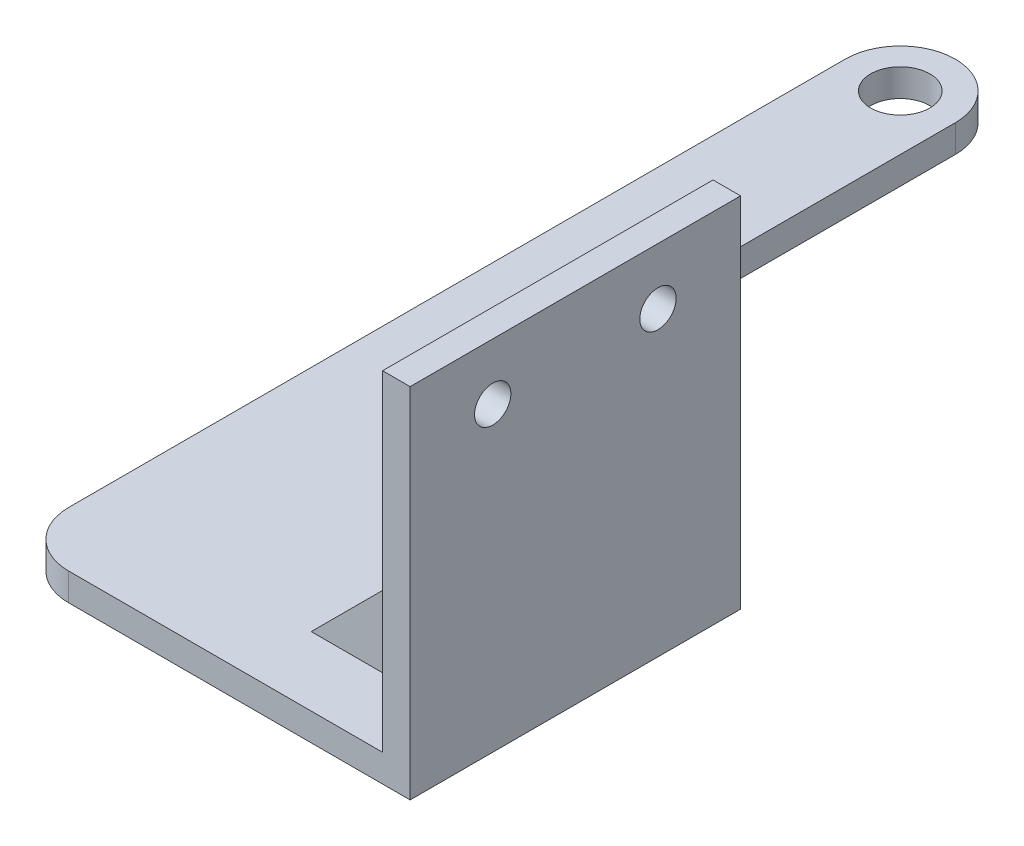
ISO-10303-21;
HEADER;
FILE_DESCRIPTION(('STEP AP214'),'2;1');
FILE_NAME('part.step','',(''),(''),'','','');
FILE_SCHEMA(('AUTOMOTIVE_DESIGN { 1 0 10303 214 1 1 1 1 }'));
ENDSEC;
DATA;
#1=APPLICATION_CONTEXT('core data for automotive mechanical design processes');
#2=APPLICATION_PROTOCOL_DEFINITION('international standard','automotive_design',2000,#1);
#3=PRODUCT_CONTEXT('',#1,'mechanical');
#4=PRODUCT('Part','Part','',(#3));
#5=PRODUCT_RELATED_PRODUCT_CATEGORY('part','',(#4));
#6=PRODUCT_DEFINITION_FORMATION('','',#4);
#7=PRODUCT_DEFINITION_CONTEXT('part definition',#1,'design');
#8=PRODUCT_DEFINITION('design','',#6,#7);
#9=PRODUCT_DEFINITION_SHAPE('','',#8);
#10=(LENGTH_UNIT() NAMED_UNIT(*) SI_UNIT(.MILLI.,.METRE.));
#11=(NAMED_UNIT(*) PLANE_ANGLE_UNIT() SI_UNIT($,.RADIAN.));
#12=(NAMED_UNIT(*) SI_UNIT($,.STERADIAN.) SOLID_ANGLE_UNIT());
#13=UNCERTAINTY_MEASURE_WITH_UNIT(LENGTH_MEASURE(1.E-05),#10,'distance_accuracy_value','');
#14=(GEOMETRIC_REPRESENTATION_CONTEXT(3) GLOBAL_UNCERTAINTY_ASSIGNED_CONTEXT((#13)) GLOBAL_UNIT_ASSIGNED_CONTEXT((#10,
#11,#12)) REPRESENTATION_CONTEXT('',''));
#15=CARTESIAN_POINT('',(0.,0.,0.));
#16=DIRECTION('',(0.,0.,1.));
#17=DIRECTION('',(1.,0.,0.));
#18=AXIS2_PLACEMENT_3D('',#15,#16,#17);
#19=CARTESIAN_POINT('',(-4.99999999999999,-50.,60.));
#20=DIRECTION('',(1.,0.,0.));
#21=DIRECTION('',(0.,1.,0.));
#22=AXIS2_PLACEMENT_3D('',#19,#20,#21);
#23=PLANE('',#22);
#24=CARTESIAN_POINT('',(-4.99999999999998,-10.25,45.));
#25=DIRECTION('',(-1.,0.,0.));
#26=DIRECTION('',(0.,-1.,0.));
#27=AXIS2_PLACEMENT_3D('',#24,#25,#26);
#28=CIRCLE('',#27,3.3);
#29=CARTESIAN_POINT('',(-4.99999999999998,-13.55,45.));
#30=VERTEX_POINT('',#29);
#31=EDGE_CURVE('E204',#30,#30,#28,.T.);
#32=ORIENTED_EDGE('',*,*,#31,.F.);
#33=EDGE_LOOP('',(#32));
#34=FACE_BOUND('',#33,.T.);
#35=CARTESIAN_POINT('',(-4.99999999999998,-10.25,15.));
#36=DIRECTION('',(-1.,0.,0.));
#37=DIRECTION('',(0.,-1.,0.));
#38=AXIS2_PLACEMENT_3D('',#35,#36,#37);
#39=CIRCLE('',#38,3.3);
#40=CARTESIAN_POINT('',(-4.99999999999998,-13.55,15.));
#41=VERTEX_POINT('',#40);
#42=EDGE_CURVE('E208',#41,#41,#39,.T.);
#43=ORIENTED_EDGE('',*,*,#42,.F.);
#44=EDGE_LOOP('',(#43));
#45=FACE_BOUND('',#44,.T.);
#46=DIRECTION('',(0.,1.,0.));
#47=VECTOR('',#46,1.);
#48=CARTESIAN_POINT('',(-4.99999999999999,-60.,17.5));
#49=LINE('',#48,#47);
#50=CARTESIAN_POINT('',(-4.99999999999999,-60.,17.5));
#51=VERTEX_POINT('',#50);
#52=CARTESIAN_POINT('',(-5.,-34.5441558772843,17.5));
#53=VERTEX_POINT('',#52);
#54=EDGE_CURVE('E161',#51,#53,#49,.T.);
#55=ORIENTED_EDGE('',*,*,#54,.F.);
#56=DIRECTION('',(0.,0.,-1.));
#57=VECTOR('',#56,1.);
#58=CARTESIAN_POINT('',(-4.99999999999998,-60.,0.));
#59=LINE('',#58,#57);
#60=CARTESIAN_POINT('',(-4.99999999999999,-60.,42.5));
#61=VERTEX_POINT('',#60);
#62=EDGE_CURVE('E176',#61,#51,#59,.T.);
#63=ORIENTED_EDGE('',*,*,#62,.F.);
#64=DIRECTION('',(0.,1.,0.));
#65=VECTOR('',#64,1.);
#66=CARTESIAN_POINT('',(-4.99999999999999,-60.,42.5));
#67=LINE('',#66,#65);
#68=CARTESIAN_POINT('',(-5.,-34.5441558772843,42.5));
#69=VERTEX_POINT('',#68);
#70=EDGE_CURVE('E188',#61,#69,#67,.T.);
#71=ORIENTED_EDGE('',*,*,#70,.T.);
#72=DIRECTION('',(0.,0.,1.));
#73=VECTOR('',#72,1.);
#74=CARTESIAN_POINT('',(-5.,-34.5441558772843,42.5));
#75=LINE('',#74,#73);
#76=CARTESIAN_POINT('',(-5.,-34.5441558772843,47.5));
#77=VERTEX_POINT('',#76);
#78=EDGE_CURVE('E194',#69,#77,#75,.T.);
#79=ORIENTED_EDGE('',*,*,#78,.T.);
#80=DIRECTION('',(0.,1.,0.));
#81=VECTOR('',#80,1.);
#82=CARTESIAN_POINT('',(-4.99999999999999,-60.,47.5));
#83=LINE('',#82,#81);
#84=CARTESIAN_POINT('',(-4.99999999999999,-60.,47.5));
#85=VERTEX_POINT('',#84);
#86=EDGE_CURVE('E196',#85,#77,#83,.T.);
#87=ORIENTED_EDGE('',*,*,#86,.F.);
#88=CARTESIAN_POINT('',(-4.99999999999999,-60.,60.));
#89=VERTEX_POINT('',#88);
#90=EDGE_CURVE('E233',#89,#85,#59,.T.);
#91=ORIENTED_EDGE('',*,*,#90,.F.);
#92=DIRECTION('',(0.,-1.,0.));
#93=VECTOR('',#92,1.);
#94=CARTESIAN_POINT('',(-5.,0.,60.));
#95=LINE('',#94,#93);
#96=CARTESIAN_POINT('',(-5.,0.,60.));
#97=VERTEX_POINT('',#96);
#98=EDGE_CURVE('E249',#97,#89,#95,.T.);
#99=ORIENTED_EDGE('',*,*,#98,.F.);
#100=DIRECTION('',(0.,0.,-1.));
#101=VECTOR('',#100,1.);
#102=CARTESIAN_POINT('',(-5.,0.,60.));
#103=LINE('',#102,#101);
#104=CARTESIAN_POINT('',(-5.,0.,0.));
#105=VERTEX_POINT('',#104);
#106=EDGE_CURVE('E266',#97,#105,#103,.T.);
#107=ORIENTED_EDGE('',*,*,#106,.T.);
#108=DIRECTION('',(0.,-1.,0.));
#109=VECTOR('',#108,1.);
#110=CARTESIAN_POINT('',(-4.99999999999999,-50.,0.));
#111=LINE('',#110,#109);
#112=CARTESIAN_POINT('',(-4.99999999999998,-60.,0.));
#113=VERTEX_POINT('',#112);
#114=EDGE_CURVE('E260',#105,#113,#111,.T.);
#115=ORIENTED_EDGE('',*,*,#114,.T.);
#116=CARTESIAN_POINT('',(-4.99999999999998,-60.,12.5));
#117=VERTEX_POINT('',#116);
#118=EDGE_CURVE('E228',#117,#113,#59,.T.);
#119=ORIENTED_EDGE('',*,*,#118,.F.);
#120=DIRECTION('',(0.,1.,0.));
#121=VECTOR('',#120,1.);
#122=CARTESIAN_POINT('',(-4.99999999999999,-60.,12.5));
#123=LINE('',#122,#121);
#124=CARTESIAN_POINT('',(-5.,-34.5441558772843,12.5));
#125=VERTEX_POINT('',#124);
#126=EDGE_CURVE('E51',#117,#125,#123,.T.);
#127=ORIENTED_EDGE('',*,*,#126,.T.);
#128=DIRECTION('',(0.,0.,-1.));
#129=VECTOR('',#128,1.);
#130=CARTESIAN_POINT('',(-5.,-34.5441558772843,17.5));
#131=LINE('',#130,#129);
#132=EDGE_CURVE('E170',#53,#125,#131,.T.);
#133=ORIENTED_EDGE('',*,*,#132,.F.);
#134=EDGE_LOOP('',(#55,#63,#71,#79,#87,#91,#99,#107,#115,#119,#127,#133));
#135=FACE_BOUND('',#134,.T.);
#136=ADVANCED_FACE('F36',(#34,#45,#135),#23,.F.);
#137=CARTESIAN_POINT('',(-72.,-60.,0.));
#138=DIRECTION('',(0.,-1.,0.));
#139=DIRECTION('',(0.,0.,-1.));
#140=AXIS2_PLACEMENT_3D('',#137,#138,#139);
#141=PLANE('',#140);
#142=CARTESIAN_POINT('',(-62.,-60.,-91.));
#143=DIRECTION('',(0.,1.,0.));
#144=DIRECTION('',(0.,0.,1.));
#145=AXIS2_PLACEMENT_3D('',#142,#143,#144);
#146=CIRCLE('',#145,5.37500000000001);
#147=CARTESIAN_POINT('',(-62.,-60.,-85.625));
#148=VERTEX_POINT('',#147);
#149=EDGE_CURVE('E211',#148,#148,#146,.T.);
#150=ORIENTED_EDGE('',*,*,#149,.F.);
#151=EDGE_LOOP('',(#150));
#152=FACE_BOUND('',#151,.T.);
#153=DIRECTION('',(1.,0.,0.));
#154=VECTOR('',#153,1.);
#155=CARTESIAN_POINT('',(-30.4558441227157,-60.,17.5));
#156=LINE('',#155,#154);
#157=CARTESIAN_POINT('',(-30.4558441227157,-60.,17.5));
#158=VERTEX_POINT('',#157);
#159=EDGE_CURVE('E159',#158,#51,#156,.T.);
#160=ORIENTED_EDGE('',*,*,#159,.F.);
#161=DIRECTION('',(0.,0.,-1.));
#162=VECTOR('',#161,1.);
#163=CARTESIAN_POINT('',(-30.4558441227157,-60.,17.5));
#164=LINE('',#163,#162);
#165=CARTESIAN_POINT('',(-30.4558441227157,-60.,12.5));
#166=VERTEX_POINT('',#165);
#167=EDGE_CURVE('E166',#158,#166,#164,.T.);
#168=ORIENTED_EDGE('',*,*,#167,.T.);
#169=DIRECTION('',(1.,0.,0.));
#170=VECTOR('',#169,1.);
#171=CARTESIAN_POINT('',(-30.4558441227157,-60.,12.5));
#172=LINE('',#171,#170);
#173=EDGE_CURVE('E181',#166,#117,#172,.T.);
#174=ORIENTED_EDGE('',*,*,#173,.T.);
#175=ORIENTED_EDGE('',*,*,#118,.T.);
#176=DIRECTION('',(1.,0.,0.));
#177=VECTOR('',#176,1.);
#178=CARTESIAN_POINT('',(-72.,-60.,0.));
#179=LINE('',#178,#177);
#180=CARTESIAN_POINT('',(-42.,-60.,0.));
#181=VERTEX_POINT('',#180);
#182=EDGE_CURVE('E235',#181,#113,#179,.T.);
#183=ORIENTED_EDGE('',*,*,#182,.F.);
#184=CARTESIAN_POINT('',(-42.,-60.,-9.99999999999999));
#185=DIRECTION('',(0.,-1.,0.));
#186=DIRECTION('',(0.,0.,-1.));
#187=AXIS2_PLACEMENT_3D('',#184,#185,#186);
#188=CIRCLE('',#187,10.);
#189=CARTESIAN_POINT('',(-52.,-60.,-9.99999999999999));
#190=VERTEX_POINT('',#189);
#191=EDGE_CURVE('E295',#181,#190,#188,.T.);
#192=ORIENTED_EDGE('',*,*,#191,.T.);
#193=DIRECTION('',(0.,0.,1.));
#194=VECTOR('',#193,1.);
#195=CARTESIAN_POINT('',(-52.,-60.,-101.));
#196=LINE('',#195,#194);
#197=CARTESIAN_POINT('',(-52.,-60.,-91.));
#198=VERTEX_POINT('',#197);
#199=EDGE_CURVE('E225',#198,#190,#196,.T.);
#200=ORIENTED_EDGE('',*,*,#199,.F.);
#201=CARTESIAN_POINT('',(-62.,-60.,-91.));
#202=DIRECTION('',(0.,-1.,0.));
#203=DIRECTION('',(0.,0.,-1.));
#204=AXIS2_PLACEMENT_3D('',#201,#202,#203);
#205=CIRCLE('',#204,10.);
#206=CARTESIAN_POINT('',(-62.,-60.,-101.));
#207=VERTEX_POINT('',#206);
#208=EDGE_CURVE('E282',#198,#207,#205,.F.);
#209=ORIENTED_EDGE('',*,*,#208,.T.);
#210=CARTESIAN_POINT('',(-62.,-60.,-91.));
#211=DIRECTION('',(0.,-1.,0.));
#212=DIRECTION('',(0.,0.,-1.));
#213=AXIS2_PLACEMENT_3D('',#210,#211,#212);
#214=CIRCLE('',#213,10.);
#215=CARTESIAN_POINT('',(-72.,-60.,-91.));
#216=VERTEX_POINT('',#215);
#217=EDGE_CURVE('E279',#207,#216,#214,.F.);
#218=ORIENTED_EDGE('',*,*,#217,.T.);
#219=DIRECTION('',(0.,0.,-1.));
#220=VECTOR('',#219,1.);
#221=CARTESIAN_POINT('',(-72.,-60.,0.));
#222=LINE('',#221,#220);
#223=CARTESIAN_POINT('',(-72.,-60.,50.));
#224=VERTEX_POINT('',#223);
#225=EDGE_CURVE('E232',#224,#216,#222,.T.);
#226=ORIENTED_EDGE('',*,*,#225,.F.);
#227=CARTESIAN_POINT('',(-62.,-60.,50.));
#228=DIRECTION('',(0.,-1.,0.));
#229=DIRECTION('',(0.,0.,-1.));
#230=AXIS2_PLACEMENT_3D('',#227,#228,#229);
#231=CIRCLE('',#230,10.);
#232=CARTESIAN_POINT('',(-62.,-60.,60.));
#233=VERTEX_POINT('',#232);
#234=EDGE_CURVE('E300',#224,#233,#231,.F.);
#235=ORIENTED_EDGE('',*,*,#234,.T.);
#236=DIRECTION('',(1.,0.,0.));
#237=VECTOR('',#236,1.);
#238=CARTESIAN_POINT('',(-72.,-60.,60.));
#239=LINE('',#238,#237);
#240=EDGE_CURVE('E240',#233,#89,#239,.T.);
#241=ORIENTED_EDGE('',*,*,#240,.T.);
#242=ORIENTED_EDGE('',*,*,#90,.T.);
#243=DIRECTION('',(1.,0.,0.));
#244=VECTOR('',#243,1.);
#245=CARTESIAN_POINT('',(-30.4558441227157,-60.,47.5));
#246=LINE('',#245,#244);
#247=CARTESIAN_POINT('',(-30.4558441227157,-60.,47.5));
#248=VERTEX_POINT('',#247);
#249=EDGE_CURVE('E184',#248,#85,#246,.T.);
#250=ORIENTED_EDGE('',*,*,#249,.F.);
#251=DIRECTION('',(0.,0.,1.));
#252=VECTOR('',#251,1.);
#253=CARTESIAN_POINT('',(-30.4558441227157,-60.,42.5));
#254=LINE('',#253,#252);
#255=CARTESIAN_POINT('',(-30.4558441227157,-60.,42.5));
#256=VERTEX_POINT('',#255);
#257=EDGE_CURVE('E199',#256,#248,#254,.T.);
#258=ORIENTED_EDGE('',*,*,#257,.F.);
#259=DIRECTION('',(1.,0.,0.));
#260=VECTOR('',#259,1.);
#261=CARTESIAN_POINT('',(-30.4558441227157,-60.,42.5));
#262=LINE('',#261,#260);
#263=EDGE_CURVE('E186',#256,#61,#262,.T.);
#264=ORIENTED_EDGE('',*,*,#263,.T.);
#265=ORIENTED_EDGE('',*,*,#62,.T.);
#266=EDGE_LOOP('',(#160,#168,#174,#175,#183,#192,#200,#209,#218,#226,#235,#241,#242,#250,#258,
#264,#265));
#267=FACE_BOUND('',#266,.T.);
#268=ADVANCED_FACE('F173',(#152,#267),#141,.F.);
#269=CARTESIAN_POINT('',(0.,0.,0.));
#270=DIRECTION('',(0.,0.,1.));
#271=DIRECTION('',(1.,0.,0.));
#272=AXIS2_PLACEMENT_3D('',#269,#270,#271);
#273=PLANE('',#272);
#274=DIRECTION('',(1.,0.,0.));
#275=VECTOR('',#274,1.);
#276=CARTESIAN_POINT('',(-4.99999999999999,-65.,0.));
#277=LINE('',#276,#275);
#278=CARTESIAN_POINT('',(-42.,-65.,0.));
#279=VERTEX_POINT('',#278);
#280=CARTESIAN_POINT('',(0.,-65.,0.));
#281=VERTEX_POINT('',#280);
#282=EDGE_CURVE('E247',#279,#281,#277,.T.);
#283=ORIENTED_EDGE('',*,*,#282,.F.);
#284=DIRECTION('',(0.,-1.,0.));
#285=VECTOR('',#284,1.);
#286=CARTESIAN_POINT('',(-42.,-60.,0.));
#287=LINE('',#286,#285);
#288=EDGE_CURVE('E291',#279,#181,#287,.F.);
#289=ORIENTED_EDGE('',*,*,#288,.T.);
#290=ORIENTED_EDGE('',*,*,#182,.T.);
#291=ORIENTED_EDGE('',*,*,#114,.F.);
#292=DIRECTION('',(-1.,0.,0.));
#293=VECTOR('',#292,1.);
#294=CARTESIAN_POINT('',(0.,0.,0.));
#295=LINE('',#294,#293);
#296=CARTESIAN_POINT('',(0.,0.,0.));
#297=VERTEX_POINT('',#296);
#298=EDGE_CURVE('E257',#297,#105,#295,.T.);
#299=ORIENTED_EDGE('',*,*,#298,.F.);
#300=DIRECTION('',(0.,1.,0.));
#301=VECTOR('',#300,1.);
#302=CARTESIAN_POINT('',(0.,-65.,0.));
#303=LINE('',#302,#301);
#304=EDGE_CURVE('E242',#281,#297,#303,.T.);
#305=ORIENTED_EDGE('',*,*,#304,.F.);
#306=EDGE_LOOP('',(#283,#289,#290,#291,#299,#305));
#307=FACE_BOUND('',#306,.T.);
#308=ADVANCED_FACE('F340',(#307),#273,.F.);
#309=CARTESIAN_POINT('',(0.,-65.,60.));
#310=DIRECTION('',(-1.,0.,0.));
#311=DIRECTION('',(0.,-1.,0.));
#312=AXIS2_PLACEMENT_3D('',#309,#310,#311);
#313=PLANE('',#312);
#314=CARTESIAN_POINT('',(0.,-10.25,45.));
#315=DIRECTION('',(-1.,0.,0.));
#316=DIRECTION('',(0.,-1.,0.));
#317=AXIS2_PLACEMENT_3D('',#314,#315,#316);
#318=CIRCLE('',#317,3.3);
#319=CARTESIAN_POINT('',(0.,-13.55,45.));
#320=VERTEX_POINT('',#319);
#321=EDGE_CURVE('E207',#320,#320,#318,.F.);
#322=ORIENTED_EDGE('',*,*,#321,.F.);
#323=EDGE_LOOP('',(#322));
#324=FACE_BOUND('',#323,.T.);
#325=CARTESIAN_POINT('',(0.,-10.25,15.));
#326=DIRECTION('',(-1.,0.,0.));
#327=DIRECTION('',(0.,-1.,0.));
#328=AXIS2_PLACEMENT_3D('',#325,#326,#327);
#329=CIRCLE('',#328,3.3);
#330=CARTESIAN_POINT('',(0.,-13.55,15.));
#331=VERTEX_POINT('',#330);
#332=EDGE_CURVE('E212',#331,#331,#329,.F.);
#333=ORIENTED_EDGE('',*,*,#332,.F.);
#334=EDGE_LOOP('',(#333));
#335=FACE_BOUND('',#334,.T.);
#336=ORIENTED_EDGE('',*,*,#304,.T.);
#337=DIRECTION('',(0.,0.,-1.));
#338=VECTOR('',#337,1.);
#339=CARTESIAN_POINT('',(0.,0.,60.));
#340=LINE('',#339,#338);
#341=CARTESIAN_POINT('',(0.,0.,60.));
#342=VERTEX_POINT('',#341);
#343=EDGE_CURVE('E269',#342,#297,#340,.T.);
#344=ORIENTED_EDGE('',*,*,#343,.F.);
#345=DIRECTION('',(0.,1.,0.));
#346=VECTOR('',#345,1.);
#347=CARTESIAN_POINT('',(0.,-65.,60.));
#348=LINE('',#347,#346);
#349=CARTESIAN_POINT('',(0.,-65.,60.));
#350=VERTEX_POINT('',#349);
#351=EDGE_CURVE('E243',#350,#342,#348,.T.);
#352=ORIENTED_EDGE('',*,*,#351,.F.);
#353=DIRECTION('',(0.,0.,-1.));
#354=VECTOR('',#353,1.);
#355=CARTESIAN_POINT('',(0.,-65.,60.));
#356=LINE('',#355,#354);
#357=EDGE_CURVE('E254',#350,#281,#356,.T.);
#358=ORIENTED_EDGE('',*,*,#357,.T.);
#359=EDGE_LOOP('',(#336,#344,#352,#358));
#360=FACE_BOUND('',#359,.T.);
#361=ADVANCED_FACE('F343',(#324,#335,#360),#313,.F.);
#362=CARTESIAN_POINT('',(0.,0.,60.));
#363=DIRECTION('',(0.,-1.,0.));
#364=DIRECTION('',(1.,0.,0.));
#365=AXIS2_PLACEMENT_3D('',#362,#363,#364);
#366=PLANE('',#365);
#367=ORIENTED_EDGE('',*,*,#298,.T.);
#368=ORIENTED_EDGE('',*,*,#106,.F.);
#369=DIRECTION('',(-1.,0.,0.));
#370=VECTOR('',#369,1.);
#371=CARTESIAN_POINT('',(0.,0.,60.));
#372=LINE('',#371,#370);
#373=EDGE_CURVE('E246',#342,#97,#372,.T.);
#374=ORIENTED_EDGE('',*,*,#373,.F.);
#375=ORIENTED_EDGE('',*,*,#343,.T.);
#376=EDGE_LOOP('',(#367,#368,#374,#375));
#377=FACE_BOUND('',#376,.T.);
#378=ADVANCED_FACE('F347',(#377),#366,.F.);
#379=CARTESIAN_POINT('',(-4.99999999999999,-65.,60.));
#380=DIRECTION('',(0.,1.,0.));
#381=DIRECTION('',(0.,0.,1.));
#382=AXIS2_PLACEMENT_3D('',#379,#380,#381);
#383=PLANE('',#382);
#384=CARTESIAN_POINT('',(-62.,-65.,-91.));
#385=DIRECTION('',(0.,1.,0.));
#386=DIRECTION('',(0.,0.,1.));
#387=AXIS2_PLACEMENT_3D('',#384,#385,#386);
#388=CIRCLE('',#387,5.37500000000001);
#389=CARTESIAN_POINT('',(-62.,-65.,-85.625));
#390=VERTEX_POINT('',#389);
#391=EDGE_CURVE('E219',#390,#390,#388,.F.);
#392=ORIENTED_EDGE('',*,*,#391,.F.);
#393=EDGE_LOOP('',(#392));
#394=FACE_BOUND('',#393,.T.);
#395=DIRECTION('',(1.,0.,0.));
#396=VECTOR('',#395,1.);
#397=CARTESIAN_POINT('',(-4.99999999999999,-65.,60.));
#398=LINE('',#397,#396);
#399=CARTESIAN_POINT('',(-62.,-65.,60.));
#400=VERTEX_POINT('',#399);
#401=EDGE_CURVE('E252',#400,#350,#398,.T.);
#402=ORIENTED_EDGE('',*,*,#401,.F.);
#403=CARTESIAN_POINT('',(-62.,-65.,50.));
#404=DIRECTION('',(0.,1.,0.));
#405=DIRECTION('',(0.,0.,1.));
#406=AXIS2_PLACEMENT_3D('',#403,#404,#405);
#407=CIRCLE('',#406,10.);
#408=CARTESIAN_POINT('',(-72.,-65.,50.));
#409=VERTEX_POINT('',#408);
#410=EDGE_CURVE('E11',#400,#409,#407,.F.);
#411=ORIENTED_EDGE('',*,*,#410,.T.);
#412=DIRECTION('',(0.,0.,1.));
#413=VECTOR('',#412,1.);
#414=CARTESIAN_POINT('',(-72.,-65.,0.));
#415=LINE('',#414,#413);
#416=CARTESIAN_POINT('',(-72.,-65.,-91.));
#417=VERTEX_POINT('',#416);
#418=EDGE_CURVE('E229',#417,#409,#415,.T.);
#419=ORIENTED_EDGE('',*,*,#418,.F.);
#420=CARTESIAN_POINT('',(-62.,-65.,-91.));
#421=DIRECTION('',(0.,1.,0.));
#422=DIRECTION('',(0.,0.,1.));
#423=AXIS2_PLACEMENT_3D('',#420,#421,#422);
#424=CIRCLE('',#423,10.);
#425=CARTESIAN_POINT('',(-62.,-65.,-101.));
#426=VERTEX_POINT('',#425);
#427=EDGE_CURVE('E272',#417,#426,#424,.F.);
#428=ORIENTED_EDGE('',*,*,#427,.T.);
#429=CARTESIAN_POINT('',(-62.,-65.,-91.));
#430=DIRECTION('',(0.,1.,0.));
#431=DIRECTION('',(0.,0.,1.));
#432=AXIS2_PLACEMENT_3D('',#429,#430,#431);
#433=CIRCLE('',#432,10.);
#434=CARTESIAN_POINT('',(-52.,-65.,-91.));
#435=VERTEX_POINT('',#434);
#436=EDGE_CURVE('E274',#426,#435,#433,.F.);
#437=ORIENTED_EDGE('',*,*,#436,.T.);
#438=DIRECTION('',(0.,0.,1.));
#439=VECTOR('',#438,1.);
#440=CARTESIAN_POINT('',(-52.,-65.,-101.));
#441=LINE('',#440,#439);
#442=CARTESIAN_POINT('',(-52.,-65.,-9.99999999999999));
#443=VERTEX_POINT('',#442);
#444=EDGE_CURVE('E222',#435,#443,#441,.T.);
#445=ORIENTED_EDGE('',*,*,#444,.T.);
#446=CARTESIAN_POINT('',(-42.,-65.,-9.99999999999999));
#447=DIRECTION('',(0.,1.,0.));
#448=DIRECTION('',(0.,0.,1.));
#449=AXIS2_PLACEMENT_3D('',#446,#447,#448);
#450=CIRCLE('',#449,10.);
#451=EDGE_CURVE('E293',#443,#279,#450,.T.);
#452=ORIENTED_EDGE('',*,*,#451,.T.);
#453=ORIENTED_EDGE('',*,*,#282,.T.);
#454=ORIENTED_EDGE('',*,*,#357,.F.);
#455=EDGE_LOOP('',(#402,#411,#419,#428,#437,#445,#452,#453,#454));
#456=FACE_BOUND('',#455,.T.);
#457=ADVANCED_FACE('F310',(#394,#456),#383,.F.);
#458=CARTESIAN_POINT('',(0.,0.,60.));
#459=DIRECTION('',(0.,0.,1.));
#460=DIRECTION('',(1.,0.,0.));
#461=AXIS2_PLACEMENT_3D('',#458,#459,#460);
#462=PLANE('',#461);
#463=ORIENTED_EDGE('',*,*,#240,.F.);
#464=DIRECTION('',(0.,1.,0.));
#465=VECTOR('',#464,1.);
#466=CARTESIAN_POINT('',(-62.,0.,60.));
#467=LINE('',#466,#465);
#468=EDGE_CURVE('E44',#233,#400,#467,.F.);
#469=ORIENTED_EDGE('',*,*,#468,.T.);
#470=ORIENTED_EDGE('',*,*,#401,.T.);
#471=ORIENTED_EDGE('',*,*,#351,.T.);
#472=ORIENTED_EDGE('',*,*,#373,.T.);
#473=ORIENTED_EDGE('',*,*,#98,.T.);
#474=EDGE_LOOP('',(#463,#469,#470,#471,#472,#473));
#475=FACE_BOUND('',#474,.T.);
#476=ADVANCED_FACE('F305',(#475),#462,.T.);
#477=CARTESIAN_POINT('',(-72.,0.,0.));
#478=DIRECTION('',(-1.,0.,0.));
#479=DIRECTION('',(0.,0.,1.));
#480=AXIS2_PLACEMENT_3D('',#477,#478,#479);
#481=PLANE('',#480);
#482=ORIENTED_EDGE('',*,*,#418,.T.);
#483=DIRECTION('',(0.,1.,0.));
#484=VECTOR('',#483,1.);
#485=CARTESIAN_POINT('',(-72.,0.,50.));
#486=LINE('',#485,#484);
#487=EDGE_CURVE('E297',#409,#224,#486,.T.);
#488=ORIENTED_EDGE('',*,*,#487,.T.);
#489=ORIENTED_EDGE('',*,*,#225,.T.);
#490=DIRECTION('',(0.,-1.,0.));
#491=VECTOR('',#490,1.);
#492=CARTESIAN_POINT('',(-72.,-65.,-91.));
#493=LINE('',#492,#491);
#494=EDGE_CURVE('E284',#216,#417,#493,.T.);
#495=ORIENTED_EDGE('',*,*,#494,.T.);
#496=EDGE_LOOP('',(#482,#488,#489,#495));
#497=FACE_BOUND('',#496,.T.);
#498=ADVANCED_FACE('F316',(#497),#481,.T.);
#499=CARTESIAN_POINT('',(-52.,-60.,-101.));
#500=DIRECTION('',(-1.,0.,0.));
#501=DIRECTION('',(0.,-1.,0.));
#502=AXIS2_PLACEMENT_3D('',#499,#500,#501);
#503=PLANE('',#502);
#504=ORIENTED_EDGE('',*,*,#199,.T.);
#505=DIRECTION('',(0.,-1.,0.));
#506=VECTOR('',#505,1.);
#507=CARTESIAN_POINT('',(-52.,-65.,-9.99999999999999));
#508=LINE('',#507,#506);
#509=EDGE_CURVE('E286',#190,#443,#508,.T.);
#510=ORIENTED_EDGE('',*,*,#509,.T.);
#511=ORIENTED_EDGE('',*,*,#444,.F.);
#512=DIRECTION('',(0.,-1.,0.));
#513=VECTOR('',#512,1.);
#514=CARTESIAN_POINT('',(-52.,-60.,-91.));
#515=LINE('',#514,#513);
#516=EDGE_CURVE('E276',#435,#198,#515,.F.);
#517=ORIENTED_EDGE('',*,*,#516,.T.);
#518=EDGE_LOOP('',(#504,#510,#511,#517));
#519=FACE_BOUND('',#518,.T.);
#520=ADVANCED_FACE('F330',(#519),#503,.F.);
#521=CARTESIAN_POINT('',(-62.,-65.001,-91.));
#522=DIRECTION('',(0.,1.,0.));
#523=DIRECTION('',(0.,0.,1.));
#524=AXIS2_PLACEMENT_3D('',#521,#522,#523);
#525=CYLINDRICAL_SURFACE('',#524,5.37500000000001);
#526=ORIENTED_EDGE('',*,*,#149,.T.);
#527=EDGE_LOOP('',(#526));
#528=FACE_BOUND('',#527,.T.);
#529=ORIENTED_EDGE('',*,*,#391,.T.);
#530=EDGE_LOOP('',(#529));
#531=FACE_BOUND('',#530,.T.);
#532=ADVANCED_FACE('F489',(#528,#531),#525,.F.);
#533=CARTESIAN_POINT('',(0.00100000000000273,-10.25,15.));
#534=DIRECTION('',(-1.,0.,0.));
#535=DIRECTION('',(0.,-1.,0.));
#536=AXIS2_PLACEMENT_3D('',#533,#534,#535);
#537=CYLINDRICAL_SURFACE('',#536,3.3);
#538=ORIENTED_EDGE('',*,*,#42,.T.);
#539=EDGE_LOOP('',(#538));
#540=FACE_BOUND('',#539,.T.);
#541=ORIENTED_EDGE('',*,*,#332,.T.);
#542=EDGE_LOOP('',(#541));
#543=FACE_BOUND('',#542,.T.);
#544=ADVANCED_FACE('F495',(#540,#543),#537,.F.);
#545=CARTESIAN_POINT('',(0.00100000000000273,-10.25,45.));
#546=DIRECTION('',(-1.,0.,0.));
#547=DIRECTION('',(0.,-1.,0.));
#548=AXIS2_PLACEMENT_3D('',#545,#546,#547);
#549=CYLINDRICAL_SURFACE('',#548,3.3);
#550=ORIENTED_EDGE('',*,*,#31,.T.);
#551=EDGE_LOOP('',(#550));
#552=FACE_BOUND('',#551,.T.);
#553=ORIENTED_EDGE('',*,*,#321,.T.);
#554=EDGE_LOOP('',(#553));
#555=FACE_BOUND('',#554,.T.);
#556=ADVANCED_FACE('F389',(#552,#555),#549,.F.);
#557=CARTESIAN_POINT('',(-62.,0.,-91.));
#558=DIRECTION('',(0.,1.,0.));
#559=DIRECTION('',(0.,0.,1.));
#560=AXIS2_PLACEMENT_3D('',#557,#558,#559);
#561=CYLINDRICAL_SURFACE('',#560,10.);
#562=ORIENTED_EDGE('',*,*,#494,.F.);
#563=ORIENTED_EDGE('',*,*,#217,.F.);
#564=DIRECTION('',(0.,-1.,0.));
#565=VECTOR('',#564,1.);
#566=CARTESIAN_POINT('',(-62.,-60.,-101.));
#567=LINE('',#566,#565);
#568=EDGE_CURVE('E201',#426,#207,#567,.F.);
#569=ORIENTED_EDGE('',*,*,#568,.F.);
#570=ORIENTED_EDGE('',*,*,#427,.F.);
#571=EDGE_LOOP('',(#562,#563,#569,#570));
#572=FACE_BOUND('',#571,.T.);
#573=ADVANCED_FACE('F323',(#572),#561,.T.);
#574=CARTESIAN_POINT('',(-61.9999999999999,0.,-91.));
#575=DIRECTION('',(0.,-1.,0.));
#576=DIRECTION('',(1.,0.,0.));
#577=AXIS2_PLACEMENT_3D('',#574,#575,#576);
#578=CYLINDRICAL_SURFACE('',#577,10.);
#579=ORIENTED_EDGE('',*,*,#208,.F.);
#580=ORIENTED_EDGE('',*,*,#516,.F.);
#581=ORIENTED_EDGE('',*,*,#436,.F.);
#582=ORIENTED_EDGE('',*,*,#568,.T.);
#583=EDGE_LOOP('',(#579,#580,#581,#582));
#584=FACE_BOUND('',#583,.T.);
#585=ADVANCED_FACE('F328',(#584),#578,.T.);
#586=CARTESIAN_POINT('',(-42.,-60.,-9.99999999999999));
#587=DIRECTION('',(0.,1.,0.));
#588=DIRECTION('',(-1.,0.,0.));
#589=AXIS2_PLACEMENT_3D('',#586,#587,#588);
#590=CYLINDRICAL_SURFACE('',#589,10.);
#591=ORIENTED_EDGE('',*,*,#191,.F.);
#592=ORIENTED_EDGE('',*,*,#288,.F.);
#593=ORIENTED_EDGE('',*,*,#451,.F.);
#594=ORIENTED_EDGE('',*,*,#509,.F.);
#595=EDGE_LOOP('',(#591,#592,#593,#594));
#596=FACE_BOUND('',#595,.T.);
#597=ADVANCED_FACE('F336',(#596),#590,.F.);
#598=CARTESIAN_POINT('',(-62.,0.,50.));
#599=DIRECTION('',(0.,1.,0.));
#600=DIRECTION('',(0.,0.,1.));
#601=AXIS2_PLACEMENT_3D('',#598,#599,#600);
#602=CYLINDRICAL_SURFACE('',#601,10.);
#603=ORIENTED_EDGE('',*,*,#410,.F.);
#604=ORIENTED_EDGE('',*,*,#468,.F.);
#605=ORIENTED_EDGE('',*,*,#234,.F.);
#606=ORIENTED_EDGE('',*,*,#487,.F.);
#607=EDGE_LOOP('',(#603,#604,#605,#606));
#608=FACE_BOUND('',#607,.T.);
#609=ADVANCED_FACE('F38',(#608),#602,.T.);
#610=CARTESIAN_POINT('',(-30.4558441227157,-60.,42.5));
#611=DIRECTION('',(-0.707106781186548,0.707106781186547,0.));
#612=DIRECTION('',(-0.707106781186547,-0.707106781186548,0.));
#613=AXIS2_PLACEMENT_3D('',#610,#611,#612);
#614=PLANE('',#613);
#615=DIRECTION('',(-0.707106781186547,-0.707106781186548,0.));
#616=VECTOR('',#615,1.);
#617=CARTESIAN_POINT('',(-30.4558441227157,-60.,47.5));
#618=LINE('',#617,#616);
#619=EDGE_CURVE('E59',#77,#248,#618,.T.);
#620=ORIENTED_EDGE('',*,*,#619,.F.);
#621=ORIENTED_EDGE('',*,*,#78,.F.);
#622=DIRECTION('',(-0.707106781186547,-0.707106781186548,0.));
#623=VECTOR('',#622,1.);
#624=CARTESIAN_POINT('',(-30.4558441227157,-60.,42.5));
#625=LINE('',#624,#623);
#626=EDGE_CURVE('E191',#69,#256,#625,.T.);
#627=ORIENTED_EDGE('',*,*,#626,.T.);
#628=ORIENTED_EDGE('',*,*,#257,.T.);
#629=EDGE_LOOP('',(#620,#621,#627,#628));
#630=FACE_BOUND('',#629,.T.);
#631=ADVANCED_FACE('F355',(#630),#614,.T.);
#632=CARTESIAN_POINT('',(0.,0.,42.5));
#633=DIRECTION('',(0.,0.,1.));
#634=DIRECTION('',(1.,0.,0.));
#635=AXIS2_PLACEMENT_3D('',#632,#633,#634);
#636=PLANE('',#635);
#637=ORIENTED_EDGE('',*,*,#263,.F.);
#638=ORIENTED_EDGE('',*,*,#626,.F.);
#639=ORIENTED_EDGE('',*,*,#70,.F.);
#640=EDGE_LOOP('',(#637,#638,#639));
#641=FACE_BOUND('',#640,.T.);
#642=ADVANCED_FACE('F358',(#641),#636,.F.);
#643=CARTESIAN_POINT('',(0.,0.,47.5));
#644=DIRECTION('',(0.,0.,1.));
#645=DIRECTION('',(1.,0.,0.));
#646=AXIS2_PLACEMENT_3D('',#643,#644,#645);
#647=PLANE('',#646);
#648=ORIENTED_EDGE('',*,*,#249,.T.);
#649=ORIENTED_EDGE('',*,*,#86,.T.);
#650=ORIENTED_EDGE('',*,*,#619,.T.);
#651=EDGE_LOOP('',(#648,#649,#650));
#652=FACE_BOUND('',#651,.T.);
#653=ADVANCED_FACE('F353',(#652),#647,.T.);
#654=CARTESIAN_POINT('',(-30.4558441227157,-60.,17.5));
#655=DIRECTION('',(0.707106781186548,-0.707106781186547,0.));
#656=DIRECTION('',(0.707106781186547,0.707106781186548,0.));
#657=AXIS2_PLACEMENT_3D('',#654,#655,#656);
#658=PLANE('',#657);
#659=DIRECTION('',(-0.707106781186547,-0.707106781186548,0.));
#660=VECTOR('',#659,1.);
#661=CARTESIAN_POINT('',(-30.4558441227157,-60.,12.5));
#662=LINE('',#661,#660);
#663=EDGE_CURVE('E168',#125,#166,#662,.T.);
#664=ORIENTED_EDGE('',*,*,#663,.T.);
#665=ORIENTED_EDGE('',*,*,#167,.F.);
#666=DIRECTION('',(-0.707106781186547,-0.707106781186548,0.));
#667=VECTOR('',#666,1.);
#668=CARTESIAN_POINT('',(-30.4558441227157,-60.,17.5));
#669=LINE('',#668,#667);
#670=EDGE_CURVE('E155',#53,#158,#669,.T.);
#671=ORIENTED_EDGE('',*,*,#670,.F.);
#672=ORIENTED_EDGE('',*,*,#132,.T.);
#673=EDGE_LOOP('',(#664,#665,#671,#672));
#674=FACE_BOUND('',#673,.T.);
#675=ADVANCED_FACE('F167',(#674),#658,.F.);
#676=CARTESIAN_POINT('',(0.,0.,17.5));
#677=DIRECTION('',(0.,0.,-1.));
#678=DIRECTION('',(1.,0.,0.));
#679=AXIS2_PLACEMENT_3D('',#676,#677,#678);
#680=PLANE('',#679);
#681=ORIENTED_EDGE('',*,*,#159,.T.);
#682=ORIENTED_EDGE('',*,*,#54,.T.);
#683=ORIENTED_EDGE('',*,*,#670,.T.);
#684=EDGE_LOOP('',(#681,#682,#683));
#685=FACE_BOUND('',#684,.T.);
#686=ADVANCED_FACE('F157',(#685),#680,.F.);
#687=CARTESIAN_POINT('',(0.,0.,12.5));
#688=DIRECTION('',(0.,0.,-1.));
#689=DIRECTION('',(1.,0.,0.));
#690=AXIS2_PLACEMENT_3D('',#687,#688,#689);
#691=PLANE('',#690);
#692=ORIENTED_EDGE('',*,*,#173,.F.);
#693=ORIENTED_EDGE('',*,*,#663,.F.);
#694=ORIENTED_EDGE('',*,*,#126,.F.);
#695=EDGE_LOOP('',(#692,#693,#694));
#696=FACE_BOUND('',#695,.T.);
#697=ADVANCED_FACE('F440',(#696),#691,.T.);
#698=CLOSED_SHELL('',(#136,#268,#308,#361,#378,#457,#476,#498,#520,#532,#544,#556,#573,#585,
#597,#609,#631,#642,#653,#675,#686,#697));
#699=MANIFOLD_SOLID_BREP('B2',#698);
#700=ADVANCED_BREP_SHAPE_REPRESENTATION('',(#18,#699),#14);
#701=SHAPE_DEFINITION_REPRESENTATION(#9,#700);
ENDSEC;
END-ISO-10303-21;
